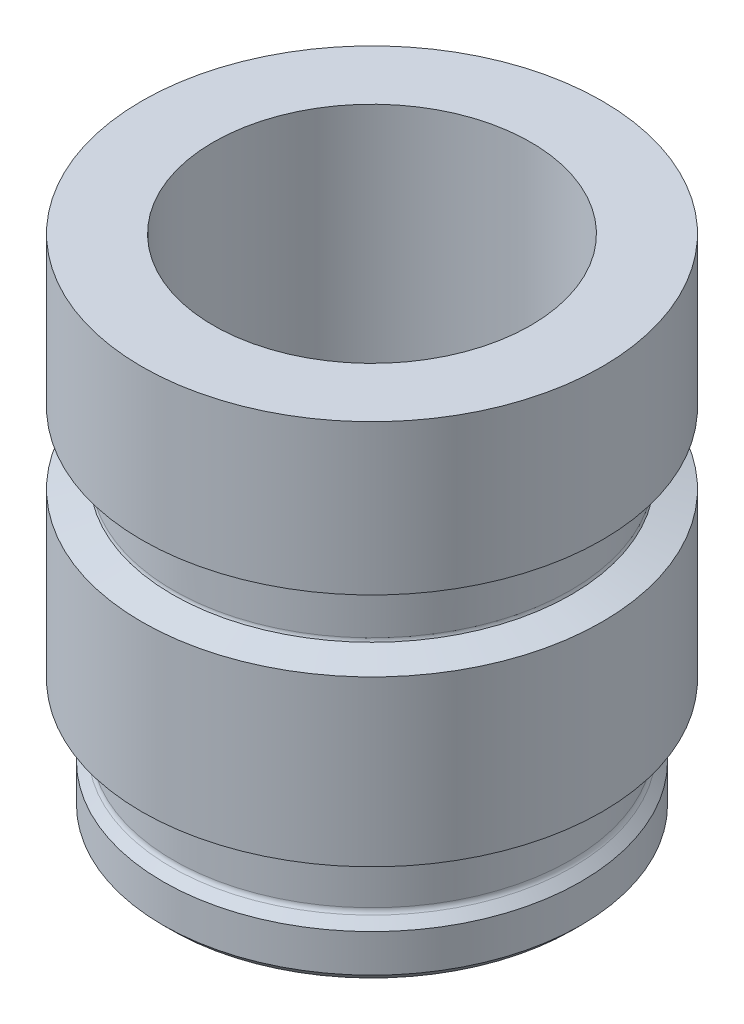
ISO-10303-21;
HEADER;
FILE_DESCRIPTION(('STEP AP214'),'2;1');
FILE_NAME('part.step','',(''),(''),'','','');
FILE_SCHEMA(('AUTOMOTIVE_DESIGN { 1 0 10303 214 1 1 1 1 }'));
ENDSEC;
DATA;
#1=APPLICATION_CONTEXT('core data for automotive mechanical design processes');
#2=APPLICATION_PROTOCOL_DEFINITION('international standard','automotive_design',2000,#1);
#3=PRODUCT_CONTEXT('',#1,'mechanical');
#4=PRODUCT('Part','Part','',(#3));
#5=PRODUCT_RELATED_PRODUCT_CATEGORY('part','',(#4));
#6=PRODUCT_DEFINITION_FORMATION('','',#4);
#7=PRODUCT_DEFINITION_CONTEXT('part definition',#1,'design');
#8=PRODUCT_DEFINITION('design','',#6,#7);
#9=PRODUCT_DEFINITION_SHAPE('','',#8);
#10=(LENGTH_UNIT() NAMED_UNIT(*) SI_UNIT(.MILLI.,.METRE.));
#11=(NAMED_UNIT(*) PLANE_ANGLE_UNIT() SI_UNIT($,.RADIAN.));
#12=(NAMED_UNIT(*) SI_UNIT($,.STERADIAN.) SOLID_ANGLE_UNIT());
#13=UNCERTAINTY_MEASURE_WITH_UNIT(LENGTH_MEASURE(1.E-05),#10,'distance_accuracy_value','');
#14=(GEOMETRIC_REPRESENTATION_CONTEXT(3) GLOBAL_UNCERTAINTY_ASSIGNED_CONTEXT((#13)) GLOBAL_UNIT_ASSIGNED_CONTEXT((#10,
#11,#12)) REPRESENTATION_CONTEXT('',''));
#15=CARTESIAN_POINT('',(0.,0.,0.));
#16=DIRECTION('',(0.,0.,1.));
#17=DIRECTION('',(1.,0.,0.));
#18=AXIS2_PLACEMENT_3D('',#15,#16,#17);
#19=CARTESIAN_POINT('',(0.,1.33,0.));
#20=DIRECTION('',(0.,-1.,0.));
#21=DIRECTION('',(1.,0.,0.));
#22=AXIS2_PLACEMENT_3D('',#19,#20,#21);
#23=CYLINDRICAL_SURFACE('',#22,4.35);
#24=CARTESIAN_POINT('',(0.,4.75,0.));
#25=DIRECTION('',(0.,-1.,0.));
#26=DIRECTION('',(1.,0.,0.));
#27=AXIS2_PLACEMENT_3D('',#24,#25,#26);
#28=CIRCLE('',#27,4.35);
#29=CARTESIAN_POINT('',(4.35,4.75,0.));
#30=VERTEX_POINT('',#29);
#31=EDGE_CURVE('E90',#30,#30,#28,.T.);
#32=ORIENTED_EDGE('',*,*,#31,.T.);
#33=EDGE_LOOP('',(#32));
#34=FACE_BOUND('',#33,.T.);
#35=CARTESIAN_POINT('',(0.,1.91341293634586,0.));
#36=DIRECTION('',(0.,1.,0.));
#37=DIRECTION('',(0.,0.,1.));
#38=AXIS2_PLACEMENT_3D('',#35,#36,#37);
#39=CIRCLE('',#38,4.35);
#40=CARTESIAN_POINT('',(0.,1.91341293634586,4.35));
#41=VERTEX_POINT('',#40);
#42=EDGE_CURVE('E94',#41,#41,#39,.T.);
#43=ORIENTED_EDGE('',*,*,#42,.T.);
#44=EDGE_LOOP('',(#43));
#45=FACE_BOUND('',#44,.T.);
#46=ADVANCED_FACE('F50',(#34,#45),#23,.T.);
#47=CARTESIAN_POINT('',(4.35,4.75,0.));
#48=DIRECTION('',(0.,1.,0.));
#49=DIRECTION('',(-1.,0.,0.));
#50=AXIS2_PLACEMENT_3D('',#47,#48,#49);
#51=PLANE('',#50);
#52=CARTESIAN_POINT('',(0.,4.75,0.));
#53=DIRECTION('',(0.,1.,0.));
#54=DIRECTION('',(-1.,0.,0.));
#55=AXIS2_PLACEMENT_3D('',#52,#53,#54);
#56=CIRCLE('',#55,3.);
#57=CARTESIAN_POINT('',(-3.,4.75,0.));
#58=VERTEX_POINT('',#57);
#59=EDGE_CURVE('E102',#58,#58,#56,.T.);
#60=ORIENTED_EDGE('',*,*,#59,.F.);
#61=EDGE_LOOP('',(#60));
#62=FACE_BOUND('',#61,.T.);
#63=ORIENTED_EDGE('',*,*,#31,.F.);
#64=EDGE_LOOP('',(#63));
#65=FACE_BOUND('',#64,.T.);
#66=ADVANCED_FACE('F141',(#62,#65),#51,.T.);
#67=CARTESIAN_POINT('',(0.,1.7575,0.));
#68=DIRECTION('',(0.,1.,0.));
#69=DIRECTION('',(0.,0.,-1.));
#70=AXIS2_PLACEMENT_3D('',#67,#68,#69);
#71=CONICAL_SURFACE('',#70,3.768125,1.30899693899575);
#72=ORIENTED_EDGE('',*,*,#42,.F.);
#73=EDGE_LOOP('',(#72));
#74=FACE_BOUND('',#73,.T.);
#75=CARTESIAN_POINT('',(0.,1.7575,0.));
#76=DIRECTION('',(0.,-1.,0.));
#77=DIRECTION('',(0.,0.,-1.));
#78=AXIS2_PLACEMENT_3D('',#75,#76,#77);
#79=CIRCLE('',#78,3.768125);
#80=CARTESIAN_POINT('',(0.,1.7575,-3.768125));
#81=VERTEX_POINT('',#80);
#82=EDGE_CURVE('E98',#81,#81,#79,.T.);
#83=ORIENTED_EDGE('',*,*,#82,.F.);
#84=EDGE_LOOP('',(#83));
#85=FACE_BOUND('',#84,.T.);
#86=ADVANCED_FACE('F132',(#74,#85),#71,.T.);
#87=CARTESIAN_POINT('',(0.,-4.75,0.));
#88=DIRECTION('',(0.,1.,0.));
#89=DIRECTION('',(-1.,0.,0.));
#90=AXIS2_PLACEMENT_3D('',#87,#88,#89);
#91=CYLINDRICAL_SURFACE('',#90,3.);
#92=ORIENTED_EDGE('',*,*,#59,.T.);
#93=EDGE_LOOP('',(#92));
#94=FACE_BOUND('',#93,.T.);
#95=CARTESIAN_POINT('',(0.,-4.75,0.));
#96=DIRECTION('',(0.,1.,0.));
#97=DIRECTION('',(-1.,0.,0.));
#98=AXIS2_PLACEMENT_3D('',#95,#96,#97);
#99=CIRCLE('',#98,3.);
#100=CARTESIAN_POINT('',(-3.,-4.75,0.));
#101=VERTEX_POINT('',#100);
#102=EDGE_CURVE('E122',#101,#101,#99,.T.);
#103=ORIENTED_EDGE('',*,*,#102,.F.);
#104=EDGE_LOOP('',(#103));
#105=FACE_BOUND('',#104,.T.);
#106=ADVANCED_FACE('F129',(#94,#105),#91,.F.);
#107=CARTESIAN_POINT('',(0.,-2.69166666666667,0.));
#108=DIRECTION('',(0.,-1.,0.));
#109=DIRECTION('',(1.,0.,0.));
#110=AXIS2_PLACEMENT_3D('',#107,#108,#109);
#111=CYLINDRICAL_SURFACE('',#110,4.35);
#112=CARTESIAN_POINT('',(0.,0.572420396987476,0.));
#113=DIRECTION('',(0.,-1.,0.));
#114=DIRECTION('',(0.,0.,-1.));
#115=AXIS2_PLACEMENT_3D('',#112,#113,#114);
#116=CIRCLE('',#115,4.35);
#117=CARTESIAN_POINT('',(0.,0.572420396987476,-4.35));
#118=VERTEX_POINT('',#117);
#119=EDGE_CURVE('E106',#118,#118,#116,.T.);
#120=ORIENTED_EDGE('',*,*,#119,.T.);
#121=EDGE_LOOP('',(#120));
#122=FACE_BOUND('',#121,.T.);
#123=CARTESIAN_POINT('',(0.,-2.53575373032081,0.));
#124=DIRECTION('',(0.,1.,0.));
#125=DIRECTION('',(0.,0.,1.));
#126=AXIS2_PLACEMENT_3D('',#123,#124,#125);
#127=CIRCLE('',#126,4.35);
#128=CARTESIAN_POINT('',(0.,-2.53575373032081,4.35));
#129=VERTEX_POINT('',#128);
#130=EDGE_CURVE('E114',#129,#129,#127,.T.);
#131=ORIENTED_EDGE('',*,*,#130,.T.);
#132=EDGE_LOOP('',(#131));
#133=FACE_BOUND('',#132,.T.);
#134=ADVANCED_FACE('F131',(#122,#133),#111,.T.);
#135=CARTESIAN_POINT('',(0.,0.728333333333333,0.));
#136=DIRECTION('',(0.,-1.,0.));
#137=DIRECTION('',(0.,0.,1.));
#138=AXIS2_PLACEMENT_3D('',#135,#136,#137);
#139=CONICAL_SURFACE('',#138,3.768125,1.30899693899575);
#140=ORIENTED_EDGE('',*,*,#119,.F.);
#141=EDGE_LOOP('',(#140));
#142=FACE_BOUND('',#141,.T.);
#143=CARTESIAN_POINT('',(0.,0.728333333333333,0.));
#144=DIRECTION('',(0.,1.,0.));
#145=DIRECTION('',(0.,0.,1.));
#146=AXIS2_PLACEMENT_3D('',#143,#144,#145);
#147=CIRCLE('',#146,3.768125);
#148=CARTESIAN_POINT('',(0.,0.728333333333333,3.768125));
#149=VERTEX_POINT('',#148);
#150=EDGE_CURVE('E110',#149,#149,#147,.T.);
#151=ORIENTED_EDGE('',*,*,#150,.F.);
#152=EDGE_LOOP('',(#151));
#153=FACE_BOUND('',#152,.T.);
#154=ADVANCED_FACE('F137',(#142,#153),#139,.T.);
#155=CARTESIAN_POINT('',(0.,-2.69166666666667,0.));
#156=DIRECTION('',(0.,1.,0.));
#157=DIRECTION('',(0.,0.,-1.));
#158=AXIS2_PLACEMENT_3D('',#155,#156,#157);
#159=CONICAL_SURFACE('',#158,3.768125,1.30899693899575);
#160=ORIENTED_EDGE('',*,*,#130,.F.);
#161=EDGE_LOOP('',(#160));
#162=FACE_BOUND('',#161,.T.);
#163=CARTESIAN_POINT('',(0.,-2.69166666666667,0.));
#164=DIRECTION('',(0.,-1.,0.));
#165=DIRECTION('',(0.,0.,-1.));
#166=AXIS2_PLACEMENT_3D('',#163,#164,#165);
#167=CIRCLE('',#166,3.768125);
#168=CARTESIAN_POINT('',(0.,-2.69166666666667,-3.768125));
#169=VERTEX_POINT('',#168);
#170=EDGE_CURVE('E118',#169,#169,#167,.T.);
#171=ORIENTED_EDGE('',*,*,#170,.F.);
#172=EDGE_LOOP('',(#171));
#173=FACE_BOUND('',#172,.T.);
#174=ADVANCED_FACE('F196',(#162,#173),#159,.T.);
#175=CARTESIAN_POINT('',(0.,-4.75,0.));
#176=DIRECTION('',(0.,-1.,0.));
#177=DIRECTION('',(1.,0.,0.));
#178=AXIS2_PLACEMENT_3D('',#175,#176,#177);
#179=CYLINDRICAL_SURFACE('',#178,3.7525);
#180=CARTESIAN_POINT('',(0.,-3.62729590766852,0.));
#181=DIRECTION('',(0.,-1.,0.));
#182=DIRECTION('',(1.,0.,0.));
#183=AXIS2_PLACEMENT_3D('',#180,#181,#182);
#184=CIRCLE('',#183,3.7525);
#185=CARTESIAN_POINT('',(3.7525,-3.62729590766852,0.));
#186=VERTEX_POINT('',#185);
#187=EDGE_CURVE('E11',#186,#186,#184,.F.);
#188=ORIENTED_EDGE('',*,*,#187,.T.);
#189=EDGE_LOOP('',(#188));
#190=FACE_BOUND('',#189,.T.);
#191=CARTESIAN_POINT('',(0.,-2.7535858428159,0.));
#192=DIRECTION('',(0.,1.,0.));
#193=DIRECTION('',(-1.,0.,0.));
#194=AXIS2_PLACEMENT_3D('',#191,#192,#193);
#195=CIRCLE('',#194,3.7525);
#196=CARTESIAN_POINT('',(-3.7525,-2.7535858428159,0.));
#197=VERTEX_POINT('',#196);
#198=EDGE_CURVE('E58',#197,#197,#195,.F.);
#199=ORIENTED_EDGE('',*,*,#198,.T.);
#200=EDGE_LOOP('',(#199));
#201=FACE_BOUND('',#200,.T.);
#202=ADVANCED_FACE('F186',(#190,#201),#179,.T.);
#203=CARTESIAN_POINT('',(0.,-4.75,0.));
#204=DIRECTION('',(0.,-1.,0.));
#205=DIRECTION('',(1.,0.,0.));
#206=AXIS2_PLACEMENT_3D('',#203,#204,#205);
#207=CYLINDRICAL_SURFACE('',#206,3.95);
#208=CARTESIAN_POINT('',(0.,-4.592,0.));
#209=DIRECTION('',(0.,-1.,0.));
#210=DIRECTION('',(1.,0.,0.));
#211=AXIS2_PLACEMENT_3D('',#208,#209,#210);
#212=CIRCLE('',#211,3.95);
#213=CARTESIAN_POINT('',(3.95,-4.592,0.));
#214=VERTEX_POINT('',#213);
#215=EDGE_CURVE('E78',#214,#214,#212,.F.);
#216=ORIENTED_EDGE('',*,*,#215,.T.);
#217=EDGE_LOOP('',(#216));
#218=FACE_BOUND('',#217,.T.);
#219=CARTESIAN_POINT('',(0.,-3.87883333333333,0.));
#220=DIRECTION('',(0.,1.,0.));
#221=DIRECTION('',(-1.,0.,0.));
#222=AXIS2_PLACEMENT_3D('',#219,#220,#221);
#223=CIRCLE('',#222,3.95);
#224=CARTESIAN_POINT('',(-3.95,-3.87883333333333,0.));
#225=VERTEX_POINT('',#224);
#226=EDGE_CURVE('E82',#225,#225,#223,.F.);
#227=ORIENTED_EDGE('',*,*,#226,.T.);
#228=EDGE_LOOP('',(#227));
#229=FACE_BOUND('',#228,.T.);
#230=ADVANCED_FACE('F184',(#218,#229),#207,.T.);
#231=CARTESIAN_POINT('',(3.95,-4.75,0.));
#232=DIRECTION('',(0.,-1.,0.));
#233=DIRECTION('',(1.,0.,0.));
#234=AXIS2_PLACEMENT_3D('',#231,#232,#233);
#235=PLANE('',#234);
#236=CARTESIAN_POINT('',(0.,-4.75,0.));
#237=DIRECTION('',(0.,-1.,0.));
#238=DIRECTION('',(1.,0.,0.));
#239=AXIS2_PLACEMENT_3D('',#236,#237,#238);
#240=CIRCLE('',#239,3.792);
#241=CARTESIAN_POINT('',(3.792,-4.75,0.));
#242=VERTEX_POINT('',#241);
#243=EDGE_CURVE('E86',#242,#242,#240,.T.);
#244=ORIENTED_EDGE('',*,*,#243,.T.);
#245=EDGE_LOOP('',(#244));
#246=FACE_BOUND('',#245,.T.);
#247=ORIENTED_EDGE('',*,*,#102,.T.);
#248=EDGE_LOOP('',(#247));
#249=FACE_BOUND('',#248,.T.);
#250=ADVANCED_FACE('F127',(#246,#249),#235,.T.);
#251=CARTESIAN_POINT('',(0.,1.69558082385077,0.));
#252=DIRECTION('',(0.,1.,0.));
#253=DIRECTION('',(0.,0.,1.));
#254=AXIS2_PLACEMENT_3D('',#251,#252,#253);
#255=CIRCLE('',#254,3.7525);
#256=CARTESIAN_POINT('',(0.,1.69558082385077,3.7525));
#257=VERTEX_POINT('',#256);
#258=EDGE_CURVE('E63',#257,#257,#255,.F.);
#259=ORIENTED_EDGE('',*,*,#258,.T.);
#260=EDGE_LOOP('',(#259));
#261=FACE_BOUND('',#260,.T.);
#262=CARTESIAN_POINT('',(0.,0.790252509482566,0.));
#263=DIRECTION('',(0.,-1.,0.));
#264=DIRECTION('',(1.,0.,0.));
#265=AXIS2_PLACEMENT_3D('',#262,#263,#264);
#266=CIRCLE('',#265,3.7525);
#267=CARTESIAN_POINT('',(3.7525,0.790252509482567,0.));
#268=VERTEX_POINT('',#267);
#269=EDGE_CURVE('E68',#268,#268,#266,.F.);
#270=ORIENTED_EDGE('',*,*,#269,.T.);
#271=EDGE_LOOP('',(#270));
#272=FACE_BOUND('',#271,.T.);
#273=ADVANCED_FACE('F160',(#261,#272),#179,.T.);
#274=CARTESIAN_POINT('',(0.,-4.75,0.));
#275=DIRECTION('',(0.,1.,0.));
#276=DIRECTION('',(-1.,0.,0.));
#277=AXIS2_PLACEMENT_3D('',#274,#275,#276);
#278=CONICAL_SURFACE('',#277,3.792,0.78539816339744);
#279=ORIENTED_EDGE('',*,*,#215,.F.);
#280=EDGE_LOOP('',(#279));
#281=FACE_BOUND('',#280,.T.);
#282=ORIENTED_EDGE('',*,*,#243,.F.);
#283=EDGE_LOOP('',(#282));
#284=FACE_BOUND('',#283,.T.);
#285=ADVANCED_FACE('F156',(#281,#284),#278,.T.);
#286=CARTESIAN_POINT('',(0.,-3.87883333333333,0.));
#287=DIRECTION('',(0.,-1.,0.));
#288=DIRECTION('',(1.,0.,0.));
#289=AXIS2_PLACEMENT_3D('',#286,#287,#288);
#290=CONICAL_SURFACE('',#289,3.95,0.785398163397448);
#291=CARTESIAN_POINT('',(0.,-3.72083333333333,0.));
#292=DIRECTION('',(0.,1.,0.));
#293=DIRECTION('',(-1.,0.,0.));
#294=AXIS2_PLACEMENT_3D('',#291,#292,#293);
#295=CIRCLE('',#294,3.792);
#296=CARTESIAN_POINT('',(-3.792,-3.72083333333333,0.));
#297=VERTEX_POINT('',#296);
#298=EDGE_CURVE('E74',#297,#297,#295,.T.);
#299=ORIENTED_EDGE('',*,*,#298,.F.);
#300=EDGE_LOOP('',(#299));
#301=FACE_BOUND('',#300,.T.);
#302=ORIENTED_EDGE('',*,*,#226,.F.);
#303=EDGE_LOOP('',(#302));
#304=FACE_BOUND('',#303,.T.);
#305=ADVANCED_FACE('F159',(#301,#304),#290,.T.);
#306=CARTESIAN_POINT('',(0.,1.69558082385077,0.));
#307=DIRECTION('',(0.,1.,0.));
#308=DIRECTION('',(0.,0.,1.));
#309=AXIS2_PLACEMENT_3D('',#306,#307,#308);
#310=TOROIDAL_SURFACE('',#309,3.883,0.1305);
#311=ORIENTED_EDGE('',*,*,#82,.T.);
#312=EDGE_LOOP('',(#311));
#313=FACE_BOUND('',#312,.T.);
#314=ORIENTED_EDGE('',*,*,#258,.F.);
#315=EDGE_LOOP('',(#314));
#316=FACE_BOUND('',#315,.T.);
#317=ADVANCED_FACE('F164',(#313,#316),#310,.F.);
#318=CARTESIAN_POINT('',(0.,0.790252509482567,0.));
#319=DIRECTION('',(0.,-1.,0.));
#320=DIRECTION('',(1.,0.,0.));
#321=AXIS2_PLACEMENT_3D('',#318,#319,#320);
#322=TOROIDAL_SURFACE('',#321,3.883,0.1305);
#323=ORIENTED_EDGE('',*,*,#150,.T.);
#324=EDGE_LOOP('',(#323));
#325=FACE_BOUND('',#324,.T.);
#326=ORIENTED_EDGE('',*,*,#269,.F.);
#327=EDGE_LOOP('',(#326));
#328=FACE_BOUND('',#327,.T.);
#329=ADVANCED_FACE('F168',(#325,#328),#322,.F.);
#330=CARTESIAN_POINT('',(0.,-3.62729590766852,0.));
#331=DIRECTION('',(0.,-1.,0.));
#332=DIRECTION('',(1.,0.,0.));
#333=AXIS2_PLACEMENT_3D('',#330,#331,#332);
#334=TOROIDAL_SURFACE('',#333,3.883,0.1305);
#335=ORIENTED_EDGE('',*,*,#187,.F.);
#336=EDGE_LOOP('',(#335));
#337=FACE_BOUND('',#336,.T.);
#338=ORIENTED_EDGE('',*,*,#298,.T.);
#339=EDGE_LOOP('',(#338));
#340=FACE_BOUND('',#339,.T.);
#341=ADVANCED_FACE('F171',(#337,#340),#334,.F.);
#342=CARTESIAN_POINT('',(0.,-2.7535858428159,0.));
#343=DIRECTION('',(0.,1.,0.));
#344=DIRECTION('',(-1.,0.,0.));
#345=AXIS2_PLACEMENT_3D('',#342,#343,#344);
#346=TOROIDAL_SURFACE('',#345,3.883,0.1305);
#347=ORIENTED_EDGE('',*,*,#170,.T.);
#348=EDGE_LOOP('',(#347));
#349=FACE_BOUND('',#348,.T.);
#350=ORIENTED_EDGE('',*,*,#198,.F.);
#351=EDGE_LOOP('',(#350));
#352=FACE_BOUND('',#351,.T.);
#353=ADVANCED_FACE('F52',(#349,#352),#346,.F.);
#354=CLOSED_SHELL('',(#46,#66,#86,#106,#134,#154,#174,#202,#230,#250,#273,#285,#305,#317,#329,
#341,#353));
#355=MANIFOLD_SOLID_BREP('B2',#354);
#356=ADVANCED_BREP_SHAPE_REPRESENTATION('',(#18,#355),#14);
#357=SHAPE_DEFINITION_REPRESENTATION(#9,#356);
ENDSEC;
END-ISO-10303-21;
